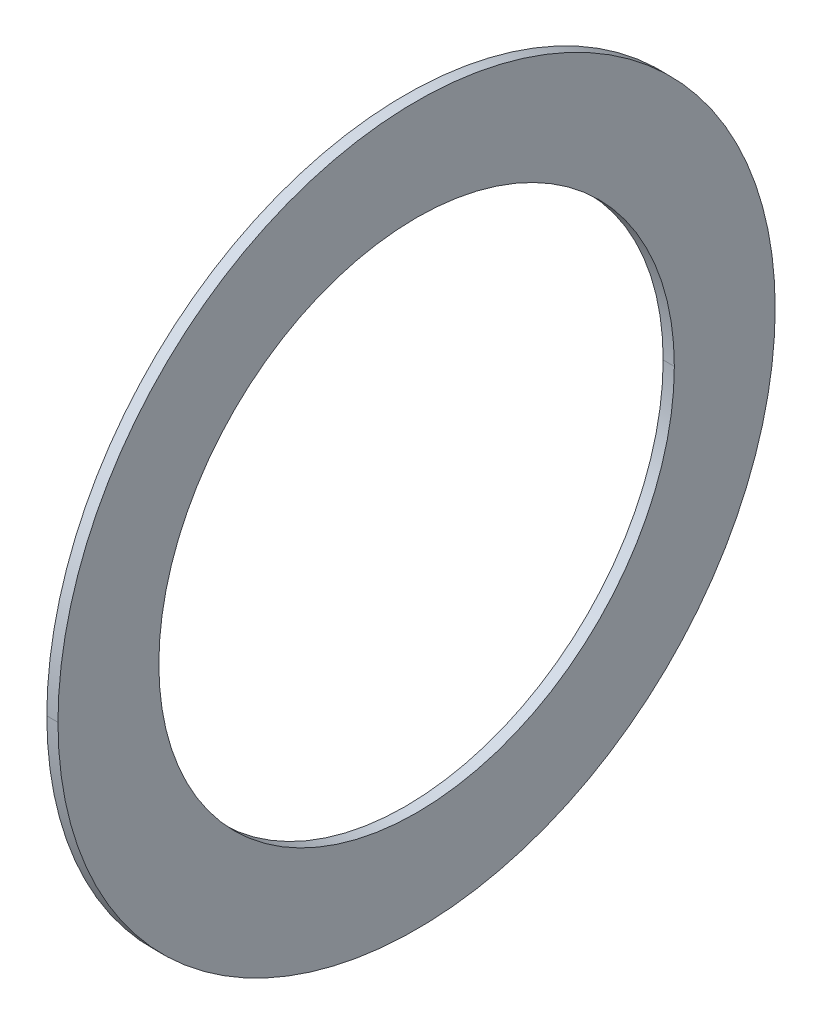
ISO-10303-21;
HEADER;
FILE_DESCRIPTION(('STEP AP214'),'2;1');
FILE_NAME('part.step','',(''),(''),'','','');
FILE_SCHEMA(('AUTOMOTIVE_DESIGN { 1 0 10303 214 1 1 1 1 }'));
ENDSEC;
DATA;
#1=APPLICATION_CONTEXT('core data for automotive mechanical design processes');
#2=APPLICATION_PROTOCOL_DEFINITION('international standard','automotive_design',2000,#1);
#3=PRODUCT_CONTEXT('',#1,'mechanical');
#4=PRODUCT('Part','Part','',(#3));
#5=PRODUCT_RELATED_PRODUCT_CATEGORY('part','',(#4));
#6=PRODUCT_DEFINITION_FORMATION('','',#4);
#7=PRODUCT_DEFINITION_CONTEXT('part definition',#1,'design');
#8=PRODUCT_DEFINITION('design','',#6,#7);
#9=PRODUCT_DEFINITION_SHAPE('','',#8);
#10=(LENGTH_UNIT() NAMED_UNIT(*) SI_UNIT(.MILLI.,.METRE.));
#11=(NAMED_UNIT(*) PLANE_ANGLE_UNIT() SI_UNIT($,.RADIAN.));
#12=(NAMED_UNIT(*) SI_UNIT($,.STERADIAN.) SOLID_ANGLE_UNIT());
#13=UNCERTAINTY_MEASURE_WITH_UNIT(LENGTH_MEASURE(1.E-05),#10,'distance_accuracy_value','');
#14=(GEOMETRIC_REPRESENTATION_CONTEXT(3) GLOBAL_UNCERTAINTY_ASSIGNED_CONTEXT((#13)) GLOBAL_UNIT_ASSIGNED_CONTEXT((#10,
#11,#12)) REPRESENTATION_CONTEXT('',''));
#15=CARTESIAN_POINT('',(0.,0.,0.));
#16=DIRECTION('',(0.,0.,1.));
#17=DIRECTION('',(1.,0.,0.));
#18=AXIS2_PLACEMENT_3D('',#15,#16,#17);
#19=CARTESIAN_POINT('',(3.7344,6.4,0.));
#20=DIRECTION('',(-1.,0.,0.));
#21=DIRECTION('',(0.,0.,1.));
#22=AXIS2_PLACEMENT_3D('',#19,#20,#21);
#23=PLANE('',#22);
#24=CARTESIAN_POINT('',(3.7344,0.,0.));
#25=DIRECTION('',(1.,0.,0.));
#26=DIRECTION('',(0.,0.,-1.));
#27=AXIS2_PLACEMENT_3D('',#24,#25,#26);
#28=CIRCLE('',#27,4.6);
#29=CARTESIAN_POINT('',(3.7344,0.,-4.6));
#30=VERTEX_POINT('',#29);
#31=CARTESIAN_POINT('',(3.7344,0.,4.6));
#32=VERTEX_POINT('',#31);
#33=EDGE_CURVE('E84',#30,#32,#28,.T.);
#34=ORIENTED_EDGE('',*,*,#33,.T.);
#35=CARTESIAN_POINT('',(3.7344,0.,0.));
#36=DIRECTION('',(1.,0.,0.));
#37=DIRECTION('',(0.,0.,-1.));
#38=AXIS2_PLACEMENT_3D('',#35,#36,#37);
#39=CIRCLE('',#38,4.6);
#40=EDGE_CURVE('E11',#32,#30,#39,.T.);
#41=ORIENTED_EDGE('',*,*,#40,.T.);
#42=EDGE_LOOP('',(#34,#41));
#43=FACE_BOUND('',#42,.T.);
#44=CARTESIAN_POINT('',(3.7344,0.,0.));
#45=DIRECTION('',(1.,0.,0.));
#46=DIRECTION('',(0.,0.,-1.));
#47=AXIS2_PLACEMENT_3D('',#44,#45,#46);
#48=CIRCLE('',#47,6.4);
#49=CARTESIAN_POINT('',(3.7344,0.,-6.4));
#50=VERTEX_POINT('',#49);
#51=CARTESIAN_POINT('',(3.7344,0.,6.4));
#52=VERTEX_POINT('',#51);
#53=EDGE_CURVE('E41',#50,#52,#48,.T.);
#54=ORIENTED_EDGE('',*,*,#53,.F.);
#55=CARTESIAN_POINT('',(3.7344,0.,0.));
#56=DIRECTION('',(1.,0.,0.));
#57=DIRECTION('',(0.,0.,-1.));
#58=AXIS2_PLACEMENT_3D('',#55,#56,#57);
#59=CIRCLE('',#58,6.4);
#60=EDGE_CURVE('E130',#52,#50,#59,.T.);
#61=ORIENTED_EDGE('',*,*,#60,.F.);
#62=EDGE_LOOP('',(#54,#61));
#63=FACE_BOUND('',#62,.T.);
#64=ADVANCED_FACE('F17',(#43,#63),#23,.T.);
#65=CARTESIAN_POINT('',(3.9336,0.,0.));
#66=DIRECTION('',(-1.,0.,0.));
#67=DIRECTION('',(0.,0.,-1.));
#68=AXIS2_PLACEMENT_3D('',#65,#66,#67);
#69=CYLINDRICAL_SURFACE('',#68,4.6);
#70=DIRECTION('',(-1.,0.,0.));
#71=VECTOR('',#70,1.);
#72=CARTESIAN_POINT('',(3.9336,0.,4.6));
#73=LINE('',#72,#71);
#74=CARTESIAN_POINT('',(3.9336,0.,4.6));
#75=VERTEX_POINT('',#74);
#76=EDGE_CURVE('E74',#75,#32,#73,.T.);
#77=ORIENTED_EDGE('',*,*,#76,.F.);
#78=CARTESIAN_POINT('',(3.9336,0.,0.));
#79=DIRECTION('',(1.,0.,0.));
#80=DIRECTION('',(0.,0.,-1.));
#81=AXIS2_PLACEMENT_3D('',#78,#79,#80);
#82=CIRCLE('',#81,4.6);
#83=CARTESIAN_POINT('',(3.9336,0.,-4.6));
#84=VERTEX_POINT('',#83);
#85=EDGE_CURVE('E28',#75,#84,#82,.T.);
#86=ORIENTED_EDGE('',*,*,#85,.T.);
#87=DIRECTION('',(-1.,0.,0.));
#88=VECTOR('',#87,1.);
#89=CARTESIAN_POINT('',(3.9336,0.,-4.6));
#90=LINE('',#89,#88);
#91=EDGE_CURVE('E71',#84,#30,#90,.T.);
#92=ORIENTED_EDGE('',*,*,#91,.T.);
#93=ORIENTED_EDGE('',*,*,#40,.F.);
#94=EDGE_LOOP('',(#77,#86,#92,#93));
#95=FACE_BOUND('',#94,.T.);
#96=ADVANCED_FACE('F70',(#95),#69,.F.);
#97=CARTESIAN_POINT('',(3.9336,4.6,0.));
#98=DIRECTION('',(1.,0.,0.));
#99=DIRECTION('',(0.,1.,0.));
#100=AXIS2_PLACEMENT_3D('',#97,#98,#99);
#101=PLANE('',#100);
#102=CARTESIAN_POINT('',(3.9336,0.,0.));
#103=DIRECTION('',(1.,0.,0.));
#104=DIRECTION('',(0.,0.,-1.));
#105=AXIS2_PLACEMENT_3D('',#102,#103,#104);
#106=CIRCLE('',#105,4.6);
#107=EDGE_CURVE('E82',#84,#75,#106,.T.);
#108=ORIENTED_EDGE('',*,*,#107,.F.);
#109=ORIENTED_EDGE('',*,*,#85,.F.);
#110=EDGE_LOOP('',(#108,#109));
#111=FACE_BOUND('',#110,.T.);
#112=CARTESIAN_POINT('',(3.9336,0.,0.));
#113=DIRECTION('',(1.,0.,0.));
#114=DIRECTION('',(0.,0.,-1.));
#115=AXIS2_PLACEMENT_3D('',#112,#113,#114);
#116=CIRCLE('',#115,6.4);
#117=CARTESIAN_POINT('',(3.9336,0.,-6.4));
#118=VERTEX_POINT('',#117);
#119=CARTESIAN_POINT('',(3.9336,0.,6.4));
#120=VERTEX_POINT('',#119);
#121=EDGE_CURVE('E136',#118,#120,#116,.T.);
#122=ORIENTED_EDGE('',*,*,#121,.T.);
#123=CARTESIAN_POINT('',(3.9336,0.,0.));
#124=DIRECTION('',(1.,0.,0.));
#125=DIRECTION('',(0.,0.,-1.));
#126=AXIS2_PLACEMENT_3D('',#123,#124,#125);
#127=CIRCLE('',#126,6.4);
#128=EDGE_CURVE('E21',#120,#118,#127,.T.);
#129=ORIENTED_EDGE('',*,*,#128,.T.);
#130=EDGE_LOOP('',(#122,#129));
#131=FACE_BOUND('',#130,.T.);
#132=ADVANCED_FACE('F19',(#111,#131),#101,.T.);
#133=CARTESIAN_POINT('',(3.9336,0.,0.));
#134=DIRECTION('',(-1.,0.,0.));
#135=DIRECTION('',(0.,0.,-1.));
#136=AXIS2_PLACEMENT_3D('',#133,#134,#135);
#137=CYLINDRICAL_SURFACE('',#136,6.4);
#138=DIRECTION('',(-1.,0.,0.));
#139=VECTOR('',#138,1.);
#140=CARTESIAN_POINT('',(3.9336,0.,6.4));
#141=LINE('',#140,#139);
#142=EDGE_CURVE('E124',#120,#52,#141,.T.);
#143=ORIENTED_EDGE('',*,*,#142,.F.);
#144=ORIENTED_EDGE('',*,*,#121,.F.);
#145=DIRECTION('',(-1.,0.,0.));
#146=VECTOR('',#145,1.);
#147=CARTESIAN_POINT('',(3.9336,0.,-6.4));
#148=LINE('',#147,#146);
#149=EDGE_CURVE('E125',#118,#50,#148,.T.);
#150=ORIENTED_EDGE('',*,*,#149,.T.);
#151=ORIENTED_EDGE('',*,*,#53,.T.);
#152=EDGE_LOOP('',(#143,#144,#150,#151));
#153=FACE_BOUND('',#152,.T.);
#154=ADVANCED_FACE('F108',(#153),#137,.T.);
#155=CARTESIAN_POINT('',(3.9336,0.,0.));
#156=DIRECTION('',(-1.,0.,0.));
#157=DIRECTION('',(0.,0.,-1.));
#158=AXIS2_PLACEMENT_3D('',#155,#156,#157);
#159=CYLINDRICAL_SURFACE('',#158,6.4);
#160=ORIENTED_EDGE('',*,*,#128,.F.);
#161=ORIENTED_EDGE('',*,*,#142,.T.);
#162=ORIENTED_EDGE('',*,*,#60,.T.);
#163=ORIENTED_EDGE('',*,*,#149,.F.);
#164=EDGE_LOOP('',(#160,#161,#162,#163));
#165=FACE_BOUND('',#164,.T.);
#166=ADVANCED_FACE('F111',(#165),#159,.T.);
#167=CARTESIAN_POINT('',(3.9336,0.,0.));
#168=DIRECTION('',(-1.,0.,0.));
#169=DIRECTION('',(0.,0.,-1.));
#170=AXIS2_PLACEMENT_3D('',#167,#168,#169);
#171=CYLINDRICAL_SURFACE('',#170,4.6);
#172=ORIENTED_EDGE('',*,*,#107,.T.);
#173=ORIENTED_EDGE('',*,*,#76,.T.);
#174=ORIENTED_EDGE('',*,*,#33,.F.);
#175=ORIENTED_EDGE('',*,*,#91,.F.);
#176=EDGE_LOOP('',(#172,#173,#174,#175));
#177=FACE_BOUND('',#176,.T.);
#178=ADVANCED_FACE('F81',(#177),#171,.F.);
#179=CLOSED_SHELL('',(#64,#96,#132,#154,#166,#178));
#180=MANIFOLD_SOLID_BREP('B1',#179);
#181=ADVANCED_BREP_SHAPE_REPRESENTATION('',(#18,#180),#14);
#182=SHAPE_DEFINITION_REPRESENTATION(#9,#181);
ENDSEC;
END-ISO-10303-21;
